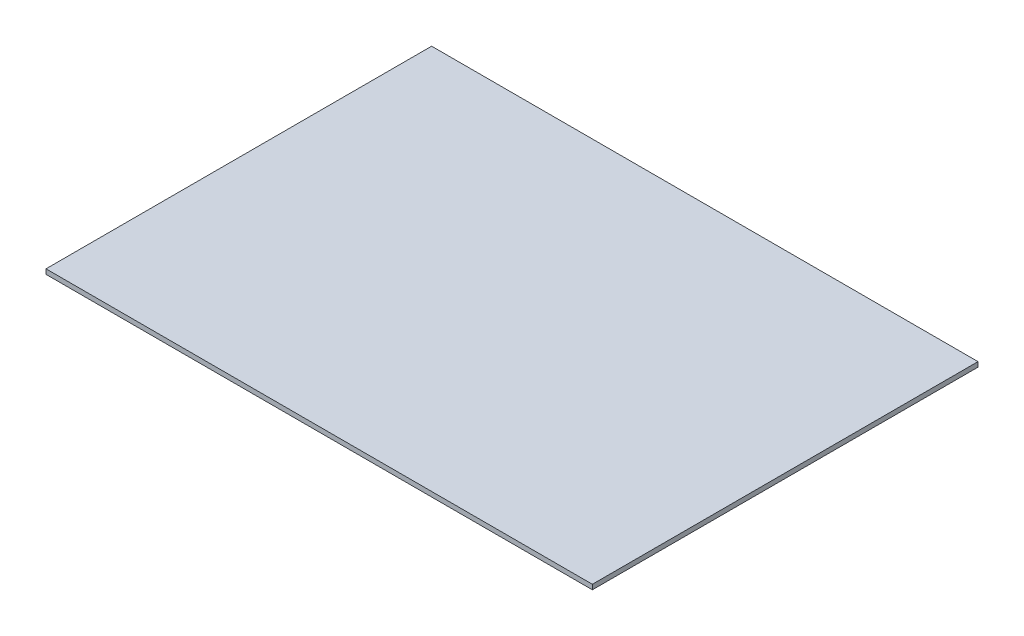
ISO-10303-21;
HEADER;
FILE_DESCRIPTION(('STEP AP214'),'2;1');
FILE_NAME('part.step','',(''),(''),'','','');
FILE_SCHEMA(('AUTOMOTIVE_DESIGN { 1 0 10303 214 1 1 1 1 }'));
ENDSEC;
DATA;
#1=APPLICATION_CONTEXT('core data for automotive mechanical design processes');
#2=APPLICATION_PROTOCOL_DEFINITION('international standard','automotive_design',2000,#1);
#3=PRODUCT_CONTEXT('',#1,'mechanical');
#4=PRODUCT('Part','Part','',(#3));
#5=PRODUCT_RELATED_PRODUCT_CATEGORY('part','',(#4));
#6=PRODUCT_DEFINITION_FORMATION('','',#4);
#7=PRODUCT_DEFINITION_CONTEXT('part definition',#1,'design');
#8=PRODUCT_DEFINITION('design','',#6,#7);
#9=PRODUCT_DEFINITION_SHAPE('','',#8);
#10=(LENGTH_UNIT() NAMED_UNIT(*) SI_UNIT(.MILLI.,.METRE.));
#11=(NAMED_UNIT(*) PLANE_ANGLE_UNIT() SI_UNIT($,.RADIAN.));
#12=(NAMED_UNIT(*) SI_UNIT($,.STERADIAN.) SOLID_ANGLE_UNIT());
#13=UNCERTAINTY_MEASURE_WITH_UNIT(LENGTH_MEASURE(1.E-05),#10,'distance_accuracy_value','');
#14=(GEOMETRIC_REPRESENTATION_CONTEXT(3) GLOBAL_UNCERTAINTY_ASSIGNED_CONTEXT((#13)) GLOBAL_UNIT_ASSIGNED_CONTEXT((#10,
#11,#12)) REPRESENTATION_CONTEXT('',''));
#15=CARTESIAN_POINT('',(0.,0.,0.));
#16=DIRECTION('',(0.,0.,1.));
#17=DIRECTION('',(1.,0.,0.));
#18=AXIS2_PLACEMENT_3D('',#15,#16,#17);
#19=CARTESIAN_POINT('',(-115.958309965263,2.54,86.2754881483777));
#20=DIRECTION('',(1.,0.,0.));
#21=DIRECTION('',(0.,0.,-1.));
#22=AXIS2_PLACEMENT_3D('',#19,#20,#21);
#23=PLANE('',#22);
#24=DIRECTION('',(0.,0.,1.));
#25=VECTOR('',#24,1.);
#26=CARTESIAN_POINT('',(-115.958309965263,0.,86.2754881483777));
#27=LINE('',#26,#25);
#28=CARTESIAN_POINT('',(-115.958309965263,0.,-116.62843582916));
#29=VERTEX_POINT('',#28);
#30=CARTESIAN_POINT('',(-115.958309965263,0.,86.2754881483777));
#31=VERTEX_POINT('',#30);
#32=EDGE_CURVE('E94',#29,#31,#27,.T.);
#33=ORIENTED_EDGE('',*,*,#32,.T.);
#34=DIRECTION('',(0.,-1.,0.));
#35=VECTOR('',#34,1.);
#36=CARTESIAN_POINT('',(-115.958309965263,2.54,86.2754881483777));
#37=LINE('',#36,#35);
#38=CARTESIAN_POINT('',(-115.958309965263,2.54,86.2754881483777));
#39=VERTEX_POINT('',#38);
#40=EDGE_CURVE('E11',#39,#31,#37,.T.);
#41=ORIENTED_EDGE('',*,*,#40,.F.);
#42=DIRECTION('',(0.,0.,1.));
#43=VECTOR('',#42,1.);
#44=CARTESIAN_POINT('',(-115.958309965263,2.54,86.2754881483777));
#45=LINE('',#44,#43);
#46=CARTESIAN_POINT('',(-115.958309965263,2.54,-116.62843582916));
#47=VERTEX_POINT('',#46);
#48=EDGE_CURVE('E82',#47,#39,#45,.T.);
#49=ORIENTED_EDGE('',*,*,#48,.F.);
#50=DIRECTION('',(0.,-1.,0.));
#51=VECTOR('',#50,1.);
#52=CARTESIAN_POINT('',(-115.958309965263,2.54,-116.62843582916));
#53=LINE('',#52,#51);
#54=EDGE_CURVE('E90',#47,#29,#53,.T.);
#55=ORIENTED_EDGE('',*,*,#54,.T.);
#56=EDGE_LOOP('',(#33,#41,#49,#55));
#57=FACE_BOUND('',#56,.T.);
#58=ADVANCED_FACE('F31',(#57),#23,.F.);
#59=CARTESIAN_POINT('',(-115.958309965263,2.54,86.2754881483777));
#60=DIRECTION('',(0.,0.,-1.));
#61=DIRECTION('',(-1.,0.,0.));
#62=AXIS2_PLACEMENT_3D('',#59,#60,#61);
#63=PLANE('',#62);
#64=DIRECTION('',(1.,0.,0.));
#65=VECTOR('',#64,1.);
#66=CARTESIAN_POINT('',(-115.958309965263,0.,86.2754881483777));
#67=LINE('',#66,#65);
#68=CARTESIAN_POINT('',(171.525435454315,0.,86.2754881483777));
#69=VERTEX_POINT('',#68);
#70=EDGE_CURVE('E86',#31,#69,#67,.T.);
#71=ORIENTED_EDGE('',*,*,#70,.T.);
#72=DIRECTION('',(0.,-1.,0.));
#73=VECTOR('',#72,1.);
#74=CARTESIAN_POINT('',(171.525435454315,2.54,86.2754881483777));
#75=LINE('',#74,#73);
#76=CARTESIAN_POINT('',(171.525435454315,2.54,86.2754881483777));
#77=VERTEX_POINT('',#76);
#78=EDGE_CURVE('E39',#77,#69,#75,.T.);
#79=ORIENTED_EDGE('',*,*,#78,.F.);
#80=DIRECTION('',(1.,0.,0.));
#81=VECTOR('',#80,1.);
#82=CARTESIAN_POINT('',(-115.958309965263,2.54,86.2754881483777));
#83=LINE('',#82,#81);
#84=EDGE_CURVE('E77',#39,#77,#83,.T.);
#85=ORIENTED_EDGE('',*,*,#84,.F.);
#86=ORIENTED_EDGE('',*,*,#40,.T.);
#87=EDGE_LOOP('',(#71,#79,#85,#86));
#88=FACE_BOUND('',#87,.T.);
#89=ADVANCED_FACE('F85',(#88),#63,.F.);
#90=CARTESIAN_POINT('',(171.525435454315,2.54,86.2754881483777));
#91=DIRECTION('',(-1.,0.,0.));
#92=DIRECTION('',(0.,0.,1.));
#93=AXIS2_PLACEMENT_3D('',#90,#91,#92);
#94=PLANE('',#93);
#95=DIRECTION('',(0.,0.,-1.));
#96=VECTOR('',#95,1.);
#97=CARTESIAN_POINT('',(171.525435454315,0.,86.2754881483777));
#98=LINE('',#97,#96);
#99=CARTESIAN_POINT('',(171.525435454315,0.,-116.62843582916));
#100=VERTEX_POINT('',#99);
#101=EDGE_CURVE('E64',#69,#100,#98,.T.);
#102=ORIENTED_EDGE('',*,*,#101,.T.);
#103=DIRECTION('',(0.,-1.,0.));
#104=VECTOR('',#103,1.);
#105=CARTESIAN_POINT('',(171.525435454315,2.54,-116.62843582916));
#106=LINE('',#105,#104);
#107=CARTESIAN_POINT('',(171.525435454315,2.54,-116.62843582916));
#108=VERTEX_POINT('',#107);
#109=EDGE_CURVE('E87',#108,#100,#106,.T.);
#110=ORIENTED_EDGE('',*,*,#109,.F.);
#111=DIRECTION('',(0.,0.,-1.));
#112=VECTOR('',#111,1.);
#113=CARTESIAN_POINT('',(171.525435454315,2.54,86.2754881483777));
#114=LINE('',#113,#112);
#115=EDGE_CURVE('E80',#77,#108,#114,.T.);
#116=ORIENTED_EDGE('',*,*,#115,.F.);
#117=ORIENTED_EDGE('',*,*,#78,.T.);
#118=EDGE_LOOP('',(#102,#110,#116,#117));
#119=FACE_BOUND('',#118,.T.);
#120=ADVANCED_FACE('F88',(#119),#94,.F.);
#121=CARTESIAN_POINT('',(-115.958309965263,2.54,-116.62843582916));
#122=DIRECTION('',(0.,0.,1.));
#123=DIRECTION('',(1.,0.,0.));
#124=AXIS2_PLACEMENT_3D('',#121,#122,#123);
#125=PLANE('',#124);
#126=DIRECTION('',(-1.,0.,0.));
#127=VECTOR('',#126,1.);
#128=CARTESIAN_POINT('',(-115.958309965263,0.,-116.62843582916));
#129=LINE('',#128,#127);
#130=EDGE_CURVE('E70',#100,#29,#129,.T.);
#131=ORIENTED_EDGE('',*,*,#130,.T.);
#132=ORIENTED_EDGE('',*,*,#54,.F.);
#133=DIRECTION('',(-1.,0.,0.));
#134=VECTOR('',#133,1.);
#135=CARTESIAN_POINT('',(-115.958309965263,2.54,-116.62843582916));
#136=LINE('',#135,#134);
#137=EDGE_CURVE('E47',#108,#47,#136,.T.);
#138=ORIENTED_EDGE('',*,*,#137,.F.);
#139=ORIENTED_EDGE('',*,*,#109,.T.);
#140=EDGE_LOOP('',(#131,#132,#138,#139));
#141=FACE_BOUND('',#140,.T.);
#142=ADVANCED_FACE('F101',(#141),#125,.F.);
#143=CARTESIAN_POINT('',(-115.958309965263,2.54,-116.62843582916));
#144=DIRECTION('',(0.,-1.,0.));
#145=DIRECTION('',(0.,0.,-1.));
#146=AXIS2_PLACEMENT_3D('',#143,#144,#145);
#147=PLANE('',#146);
#148=ORIENTED_EDGE('',*,*,#48,.T.);
#149=ORIENTED_EDGE('',*,*,#84,.T.);
#150=ORIENTED_EDGE('',*,*,#115,.T.);
#151=ORIENTED_EDGE('',*,*,#137,.T.);
#152=EDGE_LOOP('',(#148,#149,#150,#151));
#153=FACE_BOUND('',#152,.T.);
#154=ADVANCED_FACE('F78',(#153),#147,.F.);
#155=CARTESIAN_POINT('',(-115.958309965263,0.,-116.62843582916));
#156=DIRECTION('',(0.,-1.,0.));
#157=DIRECTION('',(0.,0.,-1.));
#158=AXIS2_PLACEMENT_3D('',#155,#156,#157);
#159=PLANE('',#158);
#160=ORIENTED_EDGE('',*,*,#32,.F.);
#161=ORIENTED_EDGE('',*,*,#130,.F.);
#162=ORIENTED_EDGE('',*,*,#101,.F.);
#163=ORIENTED_EDGE('',*,*,#70,.F.);
#164=EDGE_LOOP('',(#160,#161,#162,#163));
#165=FACE_BOUND('',#164,.T.);
#166=ADVANCED_FACE('F104',(#165),#159,.T.);
#167=CLOSED_SHELL('',(#58,#89,#120,#142,#154,#166));
#168=MANIFOLD_SOLID_BREP('B2',#167);
#169=ADVANCED_BREP_SHAPE_REPRESENTATION('',(#18,#168),#14);
#170=SHAPE_DEFINITION_REPRESENTATION(#9,#169);
ENDSEC;
END-ISO-10303-21;
